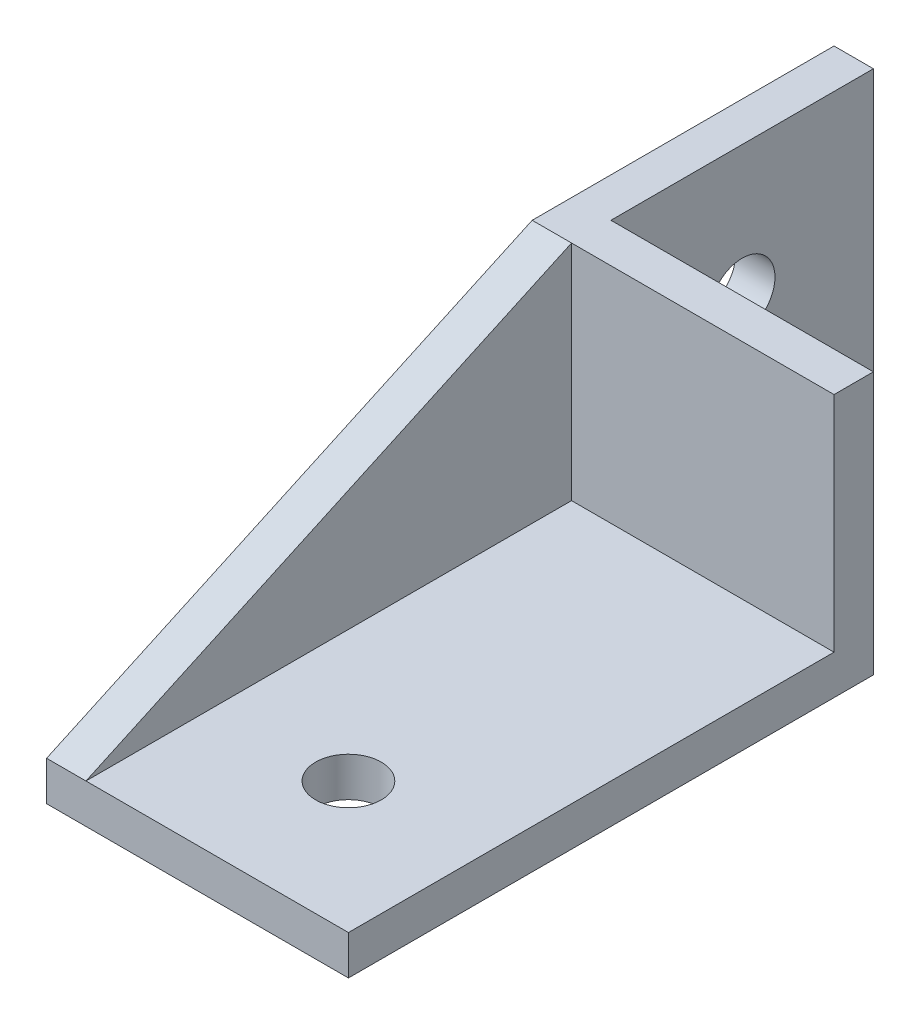
ISO-10303-21;
HEADER;
FILE_DESCRIPTION(('STEP AP214'),'2;1');
FILE_NAME('part.step','',(''),(''),'','','');
FILE_SCHEMA(('AUTOMOTIVE_DESIGN { 1 0 10303 214 1 1 1 1 }'));
ENDSEC;
DATA;
#1=APPLICATION_CONTEXT('core data for automotive mechanical design processes');
#2=APPLICATION_PROTOCOL_DEFINITION('international standard','automotive_design',2000,#1);
#3=PRODUCT_CONTEXT('',#1,'mechanical');
#4=PRODUCT('Part','Part','',(#3));
#5=PRODUCT_RELATED_PRODUCT_CATEGORY('part','',(#4));
#6=PRODUCT_DEFINITION_FORMATION('','',#4);
#7=PRODUCT_DEFINITION_CONTEXT('part definition',#1,'design');
#8=PRODUCT_DEFINITION('design','',#6,#7);
#9=PRODUCT_DEFINITION_SHAPE('','',#8);
#10=(LENGTH_UNIT() NAMED_UNIT(*) SI_UNIT(.MILLI.,.METRE.));
#11=(NAMED_UNIT(*) PLANE_ANGLE_UNIT() SI_UNIT($,.RADIAN.));
#12=(NAMED_UNIT(*) SI_UNIT($,.STERADIAN.) SOLID_ANGLE_UNIT());
#13=UNCERTAINTY_MEASURE_WITH_UNIT(LENGTH_MEASURE(1.E-05),#10,'distance_accuracy_value','');
#14=(GEOMETRIC_REPRESENTATION_CONTEXT(3) GLOBAL_UNCERTAINTY_ASSIGNED_CONTEXT((#13)) GLOBAL_UNIT_ASSIGNED_CONTEXT((#10,
#11,#12)) REPRESENTATION_CONTEXT('',''));
#15=CARTESIAN_POINT('',(0.,0.,0.));
#16=DIRECTION('',(0.,0.,1.));
#17=DIRECTION('',(1.,0.,0.));
#18=AXIS2_PLACEMENT_3D('',#15,#16,#17);
#19=CARTESIAN_POINT('',(0.,20.,3.));
#20=DIRECTION('',(0.,0.,-1.));
#21=DIRECTION('',(-1.,0.,0.));
#22=AXIS2_PLACEMENT_3D('',#19,#20,#21);
#23=PLANE('',#22);
#24=DIRECTION('',(0.,1.,0.));
#25=VECTOR('',#24,1.);
#26=CARTESIAN_POINT('',(0.,20.,3.));
#27=LINE('',#26,#25);
#28=CARTESIAN_POINT('',(0.,3.,3.));
#29=VERTEX_POINT('',#28);
#30=CARTESIAN_POINT('',(0.,20.,3.));
#31=VERTEX_POINT('',#30);
#32=EDGE_CURVE('E213',#29,#31,#27,.T.);
#33=ORIENTED_EDGE('',*,*,#32,.F.);
#34=DIRECTION('',(-1.,0.,0.));
#35=VECTOR('',#34,1.);
#36=CARTESIAN_POINT('',(0.,3.,3.));
#37=LINE('',#36,#35);
#38=CARTESIAN_POINT('',(20.,3.,3.));
#39=VERTEX_POINT('',#38);
#40=EDGE_CURVE('E11',#39,#29,#37,.T.);
#41=ORIENTED_EDGE('',*,*,#40,.F.);
#42=DIRECTION('',(0.,-1.,0.));
#43=VECTOR('',#42,1.);
#44=CARTESIAN_POINT('',(20.,20.,3.));
#45=LINE('',#44,#43);
#46=CARTESIAN_POINT('',(20.,20.,3.));
#47=VERTEX_POINT('',#46);
#48=EDGE_CURVE('E131',#47,#39,#45,.T.);
#49=ORIENTED_EDGE('',*,*,#48,.F.);
#50=DIRECTION('',(1.,0.,0.));
#51=VECTOR('',#50,1.);
#52=CARTESIAN_POINT('',(0.,20.,3.));
#53=LINE('',#52,#51);
#54=EDGE_CURVE('E62',#31,#47,#53,.T.);
#55=ORIENTED_EDGE('',*,*,#54,.F.);
#56=EDGE_LOOP('',(#33,#41,#49,#55));
#57=FACE_BOUND('',#56,.T.);
#58=ADVANCED_FACE('F39',(#57),#23,.F.);
#59=CARTESIAN_POINT('',(20.,20.,0.));
#60=DIRECTION('',(1.,0.,0.));
#61=DIRECTION('',(0.,0.,-1.));
#62=AXIS2_PLACEMENT_3D('',#59,#60,#61);
#63=PLANE('',#62);
#64=DIRECTION('',(0.,0.,1.));
#65=VECTOR('',#64,1.);
#66=CARTESIAN_POINT('',(20.,0.,0.));
#67=LINE('',#66,#65);
#68=CARTESIAN_POINT('',(20.,0.,0.));
#69=VERTEX_POINT('',#68);
#70=CARTESIAN_POINT('',(20.,0.,40.));
#71=VERTEX_POINT('',#70);
#72=EDGE_CURVE('E132',#69,#71,#67,.T.);
#73=ORIENTED_EDGE('',*,*,#72,.F.);
#74=DIRECTION('',(0.,-1.,0.));
#75=VECTOR('',#74,1.);
#76=CARTESIAN_POINT('',(20.,20.,0.));
#77=LINE('',#76,#75);
#78=CARTESIAN_POINT('',(20.,20.,0.));
#79=VERTEX_POINT('',#78);
#80=EDGE_CURVE('E48',#79,#69,#77,.T.);
#81=ORIENTED_EDGE('',*,*,#80,.F.);
#82=DIRECTION('',(0.,0.,1.));
#83=VECTOR('',#82,1.);
#84=CARTESIAN_POINT('',(20.,20.,0.));
#85=LINE('',#84,#83);
#86=EDGE_CURVE('E149',#79,#47,#85,.T.);
#87=ORIENTED_EDGE('',*,*,#86,.T.);
#88=ORIENTED_EDGE('',*,*,#48,.T.);
#89=DIRECTION('',(0.,0.,1.));
#90=VECTOR('',#89,1.);
#91=CARTESIAN_POINT('',(20.,3.,0.));
#92=LINE('',#91,#90);
#93=CARTESIAN_POINT('',(20.,3.,40.));
#94=VERTEX_POINT('',#93);
#95=EDGE_CURVE('E192',#39,#94,#92,.T.);
#96=ORIENTED_EDGE('',*,*,#95,.T.);
#97=DIRECTION('',(0.,-1.,0.));
#98=VECTOR('',#97,1.);
#99=CARTESIAN_POINT('',(20.,3.,40.));
#100=LINE('',#99,#98);
#101=EDGE_CURVE('E137',#94,#71,#100,.T.);
#102=ORIENTED_EDGE('',*,*,#101,.T.);
#103=EDGE_LOOP('',(#73,#81,#87,#88,#96,#102));
#104=FACE_BOUND('',#103,.T.);
#105=ADVANCED_FACE('F41',(#104),#63,.T.);
#106=CARTESIAN_POINT('',(0.,20.,0.));
#107=DIRECTION('',(0.,0.,-1.));
#108=DIRECTION('',(-1.,0.,0.));
#109=AXIS2_PLACEMENT_3D('',#106,#107,#108);
#110=PLANE('',#109);
#111=DIRECTION('',(1.,0.,0.));
#112=VECTOR('',#111,1.);
#113=CARTESIAN_POINT('',(0.,0.,0.));
#114=LINE('',#113,#112);
#115=CARTESIAN_POINT('',(0.,0.,0.));
#116=VERTEX_POINT('',#115);
#117=EDGE_CURVE('E136',#116,#69,#114,.T.);
#118=ORIENTED_EDGE('',*,*,#117,.F.);
#119=DIRECTION('',(0.,-1.,0.));
#120=VECTOR('',#119,1.);
#121=CARTESIAN_POINT('',(0.,20.,0.));
#122=LINE('',#121,#120);
#123=CARTESIAN_POINT('',(0.,20.,0.));
#124=VERTEX_POINT('',#123);
#125=EDGE_CURVE('E116',#124,#116,#122,.T.);
#126=ORIENTED_EDGE('',*,*,#125,.F.);
#127=DIRECTION('',(1.,0.,0.));
#128=VECTOR('',#127,1.);
#129=CARTESIAN_POINT('',(0.,20.,0.));
#130=LINE('',#129,#128);
#131=EDGE_CURVE('E107',#124,#79,#130,.T.);
#132=ORIENTED_EDGE('',*,*,#131,.T.);
#133=ORIENTED_EDGE('',*,*,#80,.T.);
#134=EDGE_LOOP('',(#118,#126,#132,#133));
#135=FACE_BOUND('',#134,.T.);
#136=ADVANCED_FACE('F158',(#135),#110,.T.);
#137=CARTESIAN_POINT('',(0.,20.,0.));
#138=DIRECTION('',(-1.,0.,0.));
#139=DIRECTION('',(0.,0.,1.));
#140=AXIS2_PLACEMENT_3D('',#137,#138,#139);
#141=PLANE('',#140);
#142=CARTESIAN_POINT('',(0.,10.,-10.));
#143=DIRECTION('',(1.,0.,0.));
#144=DIRECTION('',(0.,0.,-1.));
#145=AXIS2_PLACEMENT_3D('',#142,#143,#144);
#146=CIRCLE('',#145,2.5);
#147=CARTESIAN_POINT('',(0.,10.,-12.5));
#148=VERTEX_POINT('',#147);
#149=EDGE_CURVE('E233',#148,#148,#146,.T.);
#150=ORIENTED_EDGE('',*,*,#149,.F.);
#151=EDGE_LOOP('',(#150));
#152=FACE_BOUND('',#151,.T.);
#153=DIRECTION('',(0.,0.,-1.));
#154=VECTOR('',#153,1.);
#155=CARTESIAN_POINT('',(0.,0.,0.));
#156=LINE('',#155,#154);
#157=CARTESIAN_POINT('',(0.,0.,-20.));
#158=VERTEX_POINT('',#157);
#159=EDGE_CURVE('E114',#116,#158,#156,.T.);
#160=ORIENTED_EDGE('',*,*,#159,.T.);
#161=DIRECTION('',(0.,-1.,0.));
#162=VECTOR('',#161,1.);
#163=CARTESIAN_POINT('',(0.,20.,-20.));
#164=LINE('',#163,#162);
#165=CARTESIAN_POINT('',(0.,20.,-20.));
#166=VERTEX_POINT('',#165);
#167=EDGE_CURVE('E111',#166,#158,#164,.T.);
#168=ORIENTED_EDGE('',*,*,#167,.F.);
#169=DIRECTION('',(0.,0.,-1.));
#170=VECTOR('',#169,1.);
#171=CARTESIAN_POINT('',(0.,20.,0.));
#172=LINE('',#171,#170);
#173=EDGE_CURVE('E100',#124,#166,#172,.T.);
#174=ORIENTED_EDGE('',*,*,#173,.F.);
#175=ORIENTED_EDGE('',*,*,#125,.T.);
#176=EDGE_LOOP('',(#160,#168,#174,#175));
#177=FACE_BOUND('',#176,.T.);
#178=ADVANCED_FACE('F112',(#152,#177),#141,.F.);
#179=CARTESIAN_POINT('',(0.,20.,-20.));
#180=DIRECTION('',(0.,0.,1.));
#181=DIRECTION('',(1.,0.,0.));
#182=AXIS2_PLACEMENT_3D('',#179,#180,#181);
#183=PLANE('',#182);
#184=DIRECTION('',(-1.,0.,0.));
#185=VECTOR('',#184,1.);
#186=CARTESIAN_POINT('',(0.,0.,-20.));
#187=LINE('',#186,#185);
#188=CARTESIAN_POINT('',(-3.,0.,-20.));
#189=VERTEX_POINT('',#188);
#190=EDGE_CURVE('E84',#158,#189,#187,.T.);
#191=ORIENTED_EDGE('',*,*,#190,.T.);
#192=DIRECTION('',(0.,-1.,0.));
#193=VECTOR('',#192,1.);
#194=CARTESIAN_POINT('',(-3.,20.,-20.));
#195=LINE('',#194,#193);
#196=CARTESIAN_POINT('',(-3.,20.,-20.));
#197=VERTEX_POINT('',#196);
#198=EDGE_CURVE('E117',#197,#189,#195,.T.);
#199=ORIENTED_EDGE('',*,*,#198,.F.);
#200=DIRECTION('',(-1.,0.,0.));
#201=VECTOR('',#200,1.);
#202=CARTESIAN_POINT('',(0.,20.,-20.));
#203=LINE('',#202,#201);
#204=EDGE_CURVE('E105',#166,#197,#203,.T.);
#205=ORIENTED_EDGE('',*,*,#204,.F.);
#206=ORIENTED_EDGE('',*,*,#167,.T.);
#207=EDGE_LOOP('',(#191,#199,#205,#206));
#208=FACE_BOUND('',#207,.T.);
#209=ADVANCED_FACE('F119',(#208),#183,.F.);
#210=CARTESIAN_POINT('',(-3.,20.,0.));
#211=DIRECTION('',(1.,0.,0.));
#212=DIRECTION('',(0.,0.,-1.));
#213=AXIS2_PLACEMENT_3D('',#210,#211,#212);
#214=PLANE('',#213);
#215=CARTESIAN_POINT('',(-3.,10.,-10.));
#216=DIRECTION('',(1.,0.,0.));
#217=DIRECTION('',(0.,0.,-1.));
#218=AXIS2_PLACEMENT_3D('',#215,#216,#217);
#219=CIRCLE('',#218,2.5);
#220=CARTESIAN_POINT('',(-3.,10.,-12.5));
#221=VERTEX_POINT('',#220);
#222=EDGE_CURVE('E231',#221,#221,#219,.T.);
#223=ORIENTED_EDGE('',*,*,#222,.T.);
#224=EDGE_LOOP('',(#223));
#225=FACE_BOUND('',#224,.T.);
#226=DIRECTION('',(0.,0.,1.));
#227=VECTOR('',#226,1.);
#228=CARTESIAN_POINT('',(-3.,0.,0.));
#229=LINE('',#228,#227);
#230=CARTESIAN_POINT('',(-3.,0.,40.));
#231=VERTEX_POINT('',#230);
#232=EDGE_CURVE('E145',#189,#231,#229,.T.);
#233=ORIENTED_EDGE('',*,*,#232,.T.);
#234=DIRECTION('',(0.,1.,0.));
#235=VECTOR('',#234,1.);
#236=CARTESIAN_POINT('',(-3.,0.,40.));
#237=LINE('',#236,#235);
#238=CARTESIAN_POINT('',(-3.,3.,40.));
#239=VERTEX_POINT('',#238);
#240=EDGE_CURVE('E175',#231,#239,#237,.T.);
#241=ORIENTED_EDGE('',*,*,#240,.T.);
#242=DIRECTION('',(0.,0.417500171550711,-0.908676843963313));
#243=VECTOR('',#242,1.);
#244=CARTESIAN_POINT('',(-3.,3.,40.));
#245=LINE('',#244,#243);
#246=CARTESIAN_POINT('',(-3.,20.,3.));
#247=VERTEX_POINT('',#246);
#248=EDGE_CURVE('E229',#239,#247,#245,.T.);
#249=ORIENTED_EDGE('',*,*,#248,.T.);
#250=DIRECTION('',(0.,0.,1.));
#251=VECTOR('',#250,1.);
#252=CARTESIAN_POINT('',(-3.,20.,0.));
#253=LINE('',#252,#251);
#254=EDGE_CURVE('E122',#197,#247,#253,.T.);
#255=ORIENTED_EDGE('',*,*,#254,.F.);
#256=ORIENTED_EDGE('',*,*,#198,.T.);
#257=EDGE_LOOP('',(#233,#241,#249,#255,#256));
#258=FACE_BOUND('',#257,.T.);
#259=ADVANCED_FACE('F172',(#225,#258),#214,.F.);
#260=CARTESIAN_POINT('',(0.,20.,0.));
#261=DIRECTION('',(0.,1.,0.));
#262=DIRECTION('',(0.,0.,1.));
#263=AXIS2_PLACEMENT_3D('',#260,#261,#262);
#264=PLANE('',#263);
#265=ORIENTED_EDGE('',*,*,#86,.F.);
#266=ORIENTED_EDGE('',*,*,#131,.F.);
#267=ORIENTED_EDGE('',*,*,#173,.T.);
#268=ORIENTED_EDGE('',*,*,#204,.T.);
#269=ORIENTED_EDGE('',*,*,#254,.T.);
#270=EDGE_CURVE('E128',#247,#31,#53,.T.);
#271=ORIENTED_EDGE('',*,*,#270,.T.);
#272=ORIENTED_EDGE('',*,*,#54,.T.);
#273=EDGE_LOOP('',(#265,#266,#267,#268,#269,#271,#272));
#274=FACE_BOUND('',#273,.T.);
#275=ADVANCED_FACE('F102',(#274),#264,.T.);
#276=CARTESIAN_POINT('',(0.,0.,0.));
#277=DIRECTION('',(0.,1.,0.));
#278=DIRECTION('',(0.,0.,1.));
#279=AXIS2_PLACEMENT_3D('',#276,#277,#278);
#280=PLANE('',#279);
#281=CARTESIAN_POINT('',(10.,0.,30.));
#282=DIRECTION('',(0.,1.,0.));
#283=DIRECTION('',(0.,0.,1.));
#284=AXIS2_PLACEMENT_3D('',#281,#282,#283);
#285=CIRCLE('',#284,2.5);
#286=CARTESIAN_POINT('',(10.,0.,32.5));
#287=VERTEX_POINT('',#286);
#288=EDGE_CURVE('E237',#287,#287,#285,.T.);
#289=ORIENTED_EDGE('',*,*,#288,.T.);
#290=EDGE_LOOP('',(#289));
#291=FACE_BOUND('',#290,.T.);
#292=ORIENTED_EDGE('',*,*,#159,.F.);
#293=ORIENTED_EDGE('',*,*,#117,.T.);
#294=ORIENTED_EDGE('',*,*,#72,.T.);
#295=DIRECTION('',(-1.,0.,0.));
#296=VECTOR('',#295,1.);
#297=CARTESIAN_POINT('',(20.,0.,40.));
#298=LINE('',#297,#296);
#299=EDGE_CURVE('E168',#71,#231,#298,.T.);
#300=ORIENTED_EDGE('',*,*,#299,.T.);
#301=ORIENTED_EDGE('',*,*,#232,.F.);
#302=ORIENTED_EDGE('',*,*,#190,.F.);
#303=EDGE_LOOP('',(#292,#293,#294,#300,#301,#302));
#304=FACE_BOUND('',#303,.T.);
#305=ADVANCED_FACE('F165',(#291,#304),#280,.F.);
#306=CARTESIAN_POINT('',(0.,3.,0.));
#307=DIRECTION('',(0.,-1.,0.));
#308=DIRECTION('',(0.,0.,-1.));
#309=AXIS2_PLACEMENT_3D('',#306,#307,#308);
#310=PLANE('',#309);
#311=CARTESIAN_POINT('',(10.,3.,30.));
#312=DIRECTION('',(0.,1.,0.));
#313=DIRECTION('',(0.,0.,1.));
#314=AXIS2_PLACEMENT_3D('',#311,#312,#313);
#315=CIRCLE('',#314,2.5);
#316=CARTESIAN_POINT('',(10.,3.,32.5));
#317=VERTEX_POINT('',#316);
#318=EDGE_CURVE('E241',#317,#317,#315,.T.);
#319=ORIENTED_EDGE('',*,*,#318,.F.);
#320=EDGE_LOOP('',(#319));
#321=FACE_BOUND('',#320,.T.);
#322=ORIENTED_EDGE('',*,*,#95,.F.);
#323=ORIENTED_EDGE('',*,*,#40,.T.);
#324=DIRECTION('',(0.,0.,-1.));
#325=VECTOR('',#324,1.);
#326=CARTESIAN_POINT('',(0.,3.,0.));
#327=LINE('',#326,#325);
#328=CARTESIAN_POINT('',(0.,3.,40.));
#329=VERTEX_POINT('',#328);
#330=EDGE_CURVE('E202',#329,#29,#327,.T.);
#331=ORIENTED_EDGE('',*,*,#330,.F.);
#332=DIRECTION('',(-1.,0.,0.));
#333=VECTOR('',#332,1.);
#334=CARTESIAN_POINT('',(20.,3.,40.));
#335=LINE('',#334,#333);
#336=EDGE_CURVE('E196',#94,#329,#335,.T.);
#337=ORIENTED_EDGE('',*,*,#336,.F.);
#338=EDGE_LOOP('',(#322,#323,#331,#337));
#339=FACE_BOUND('',#338,.T.);
#340=ADVANCED_FACE('F205',(#321,#339),#310,.F.);
#341=CARTESIAN_POINT('',(20.,3.,40.));
#342=DIRECTION('',(0.,0.,1.));
#343=DIRECTION('',(1.,0.,0.));
#344=AXIS2_PLACEMENT_3D('',#341,#342,#343);
#345=PLANE('',#344);
#346=ORIENTED_EDGE('',*,*,#299,.F.);
#347=ORIENTED_EDGE('',*,*,#101,.F.);
#348=ORIENTED_EDGE('',*,*,#336,.T.);
#349=DIRECTION('',(-1.,0.,0.));
#350=VECTOR('',#349,1.);
#351=CARTESIAN_POINT('',(42.0594816896262,3.,40.));
#352=LINE('',#351,#350);
#353=EDGE_CURVE('E222',#329,#239,#352,.T.);
#354=ORIENTED_EDGE('',*,*,#353,.T.);
#355=ORIENTED_EDGE('',*,*,#240,.F.);
#356=EDGE_LOOP('',(#346,#347,#348,#354,#355));
#357=FACE_BOUND('',#356,.T.);
#358=ADVANCED_FACE('F200',(#357),#345,.T.);
#359=CARTESIAN_POINT('',(0.,3.,0.));
#360=DIRECTION('',(-1.,0.,0.));
#361=DIRECTION('',(0.,0.,1.));
#362=AXIS2_PLACEMENT_3D('',#359,#360,#361);
#363=PLANE('',#362);
#364=DIRECTION('',(0.,-0.417500171550711,0.908676843963313));
#365=VECTOR('',#364,1.);
#366=CARTESIAN_POINT('',(0.,3.,40.));
#367=LINE('',#366,#365);
#368=EDGE_CURVE('E218',#31,#329,#367,.T.);
#369=ORIENTED_EDGE('',*,*,#368,.T.);
#370=ORIENTED_EDGE('',*,*,#330,.T.);
#371=ORIENTED_EDGE('',*,*,#32,.T.);
#372=EDGE_LOOP('',(#369,#370,#371));
#373=FACE_BOUND('',#372,.T.);
#374=ADVANCED_FACE('F263',(#373),#363,.F.);
#375=CARTESIAN_POINT('',(42.0594816896262,3.,40.));
#376=DIRECTION('',(0.,0.908676843963313,0.417500171550711));
#377=DIRECTION('',(0.,-0.417500171550711,0.908676843963313));
#378=AXIS2_PLACEMENT_3D('',#375,#376,#377);
#379=PLANE('',#378);
#380=ORIENTED_EDGE('',*,*,#368,.F.);
#381=ORIENTED_EDGE('',*,*,#270,.F.);
#382=ORIENTED_EDGE('',*,*,#248,.F.);
#383=ORIENTED_EDGE('',*,*,#353,.F.);
#384=EDGE_LOOP('',(#380,#381,#382,#383));
#385=FACE_BOUND('',#384,.T.);
#386=ADVANCED_FACE('F332',(#385),#379,.T.);
#387=CARTESIAN_POINT('',(-3.,10.,-10.));
#388=DIRECTION('',(1.,0.,0.));
#389=DIRECTION('',(0.,0.,-1.));
#390=AXIS2_PLACEMENT_3D('',#387,#388,#389);
#391=CYLINDRICAL_SURFACE('',#390,2.5);
#392=ORIENTED_EDGE('',*,*,#222,.F.);
#393=EDGE_LOOP('',(#392));
#394=FACE_BOUND('',#393,.T.);
#395=ORIENTED_EDGE('',*,*,#149,.T.);
#396=EDGE_LOOP('',(#395));
#397=FACE_BOUND('',#396,.T.);
#398=ADVANCED_FACE('F253',(#394,#397),#391,.F.);
#399=CARTESIAN_POINT('',(10.,0.,30.));
#400=DIRECTION('',(0.,1.,0.));
#401=DIRECTION('',(0.,0.,1.));
#402=AXIS2_PLACEMENT_3D('',#399,#400,#401);
#403=CYLINDRICAL_SURFACE('',#402,2.5);
#404=ORIENTED_EDGE('',*,*,#288,.F.);
#405=EDGE_LOOP('',(#404));
#406=FACE_BOUND('',#405,.T.);
#407=ORIENTED_EDGE('',*,*,#318,.T.);
#408=EDGE_LOOP('',(#407));
#409=FACE_BOUND('',#408,.T.);
#410=ADVANCED_FACE('F250',(#406,#409),#403,.F.);
#411=CLOSED_SHELL('',(#58,#105,#136,#178,#209,#259,#275,#305,#340,#358,#374,#386,#398,#410));
#412=MANIFOLD_SOLID_BREP('B2',#411);
#413=ADVANCED_BREP_SHAPE_REPRESENTATION('',(#18,#412),#14);
#414=SHAPE_DEFINITION_REPRESENTATION(#9,#413);
ENDSEC;
END-ISO-10303-21;
